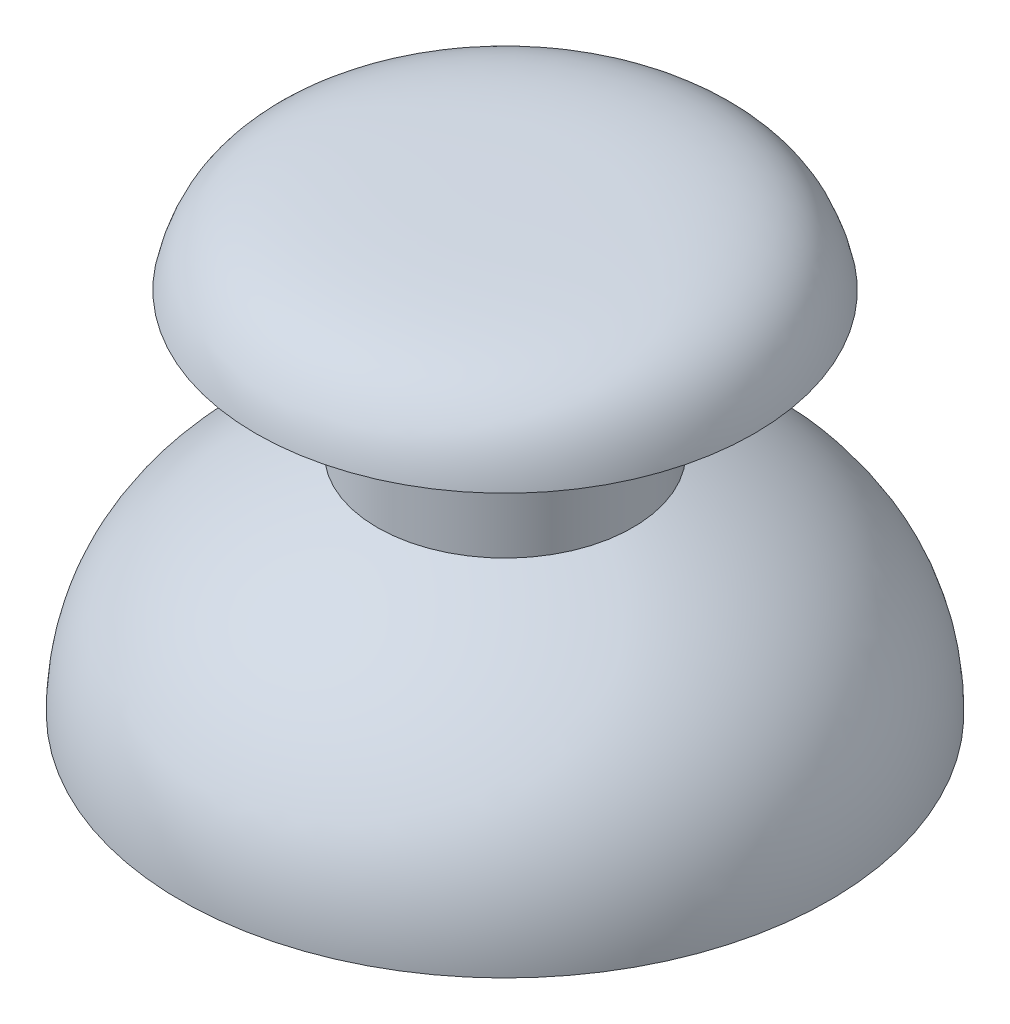
ISO-10303-21;
HEADER;
FILE_DESCRIPTION(('STEP AP214'),'2;1');
FILE_NAME('part.step','',(''),(''),'','','');
FILE_SCHEMA(('AUTOMOTIVE_DESIGN { 1 0 10303 214 1 1 1 1 }'));
ENDSEC;
DATA;
#1=APPLICATION_CONTEXT('core data for automotive mechanical design processes');
#2=APPLICATION_PROTOCOL_DEFINITION('international standard','automotive_design',2000,#1);
#3=PRODUCT_CONTEXT('',#1,'mechanical');
#4=PRODUCT('Part','Part','',(#3));
#5=PRODUCT_RELATED_PRODUCT_CATEGORY('part','',(#4));
#6=PRODUCT_DEFINITION_FORMATION('','',#4);
#7=PRODUCT_DEFINITION_CONTEXT('part definition',#1,'design');
#8=PRODUCT_DEFINITION('design','',#6,#7);
#9=PRODUCT_DEFINITION_SHAPE('','',#8);
#10=(LENGTH_UNIT() NAMED_UNIT(*) SI_UNIT(.MILLI.,.METRE.));
#11=(NAMED_UNIT(*) PLANE_ANGLE_UNIT() SI_UNIT($,.RADIAN.));
#12=(NAMED_UNIT(*) SI_UNIT($,.STERADIAN.) SOLID_ANGLE_UNIT());
#13=UNCERTAINTY_MEASURE_WITH_UNIT(LENGTH_MEASURE(1.E-05),#10,'distance_accuracy_value','');
#14=(GEOMETRIC_REPRESENTATION_CONTEXT(3) GLOBAL_UNCERTAINTY_ASSIGNED_CONTEXT((#13)) GLOBAL_UNIT_ASSIGNED_CONTEXT((#10,
#11,#12)) REPRESENTATION_CONTEXT('',''));
#15=CARTESIAN_POINT('',(0.,0.,0.));
#16=DIRECTION('',(0.,0.,1.));
#17=DIRECTION('',(1.,0.,0.));
#18=AXIS2_PLACEMENT_3D('',#15,#16,#17);
#19=CARTESIAN_POINT('',(0.,8.93607267068107,4.28417266486361));
#20=CARTESIAN_POINT('',(0.,8.85738178045405,4.50611510990907));
#21=CARTESIAN_POINT('',(0.,8.77869089022702,4.72805755495454));
#22=CARTESIAN_POINT('',(0.,8.7,4.95));
#23=CARTESIAN_POINT('',(0.,7.34033976746877,8.78483165037869));
#24=CARTESIAN_POINT('',(0.,4.78192588649418,12.5687261289951));
#25=CARTESIAN_POINT('',(0.,0.,12.5687261289951));
#26=B_SPLINE_CURVE_WITH_KNOTS('',3,(#19,#20,#21,#22,#23,#24,#25),.UNSPECIFIED.,.F.,.F.,(4,3,4),
(-0.0578754076527833,0.,1.),.UNSPECIFIED.);
#27=CARTESIAN_POINT('',(0.,0.,0.));
#28=DIRECTION('',(0.,-1.,0.));
#29=AXIS1_PLACEMENT('',#27,#28);
#30=SURFACE_OF_REVOLUTION('',#26,#29);
#31=CARTESIAN_POINT('',(0.,0.,0.));
#32=DIRECTION('',(0.,-1.,0.));
#33=DIRECTION('',(0.,0.,-1.));
#34=AXIS2_PLACEMENT_3D('',#31,#32,#33);
#35=CIRCLE('',#34,12.5687261289951);
#36=CARTESIAN_POINT('',(0.,0.,-12.5687261289951));
#37=VERTEX_POINT('',#36);
#38=EDGE_CURVE('E74',#37,#37,#35,.T.);
#39=ORIENTED_EDGE('',*,*,#38,.F.);
#40=EDGE_LOOP('',(#39));
#41=FACE_BOUND('',#40,.T.);
#42=CARTESIAN_POINT('',(0.,8.7,0.));
#43=DIRECTION('',(0.,-1.,0.));
#44=DIRECTION('',(0.,0.,-1.));
#45=AXIS2_PLACEMENT_3D('',#42,#43,#44);
#46=CIRCLE('',#45,4.95);
#47=CARTESIAN_POINT('',(0.,8.7,-4.95));
#48=VERTEX_POINT('',#47);
#49=EDGE_CURVE('E11',#48,#48,#46,.T.);
#50=ORIENTED_EDGE('',*,*,#49,.T.);
#51=EDGE_LOOP('',(#50));
#52=FACE_BOUND('',#51,.T.);
#53=ADVANCED_FACE('F17',(#41,#52),#30,.T.);
#54=CARTESIAN_POINT('',(0.,0.,0.));
#55=DIRECTION('',(0.,-1.,0.));
#56=DIRECTION('',(0.,0.,-1.));
#57=AXIS2_PLACEMENT_3D('',#54,#55,#56);
#58=CYLINDRICAL_SURFACE('',#57,4.95);
#59=ORIENTED_EDGE('',*,*,#49,.F.);
#60=EDGE_LOOP('',(#59));
#61=FACE_BOUND('',#60,.T.);
#62=CARTESIAN_POINT('',(0.,13.7,0.));
#63=DIRECTION('',(0.,-1.,0.));
#64=DIRECTION('',(0.,0.,-1.));
#65=AXIS2_PLACEMENT_3D('',#62,#63,#64);
#66=CIRCLE('',#65,4.95);
#67=CARTESIAN_POINT('',(0.,13.7,-4.95));
#68=VERTEX_POINT('',#67);
#69=EDGE_CURVE('E25',#68,#68,#66,.T.);
#70=ORIENTED_EDGE('',*,*,#69,.T.);
#71=EDGE_LOOP('',(#70));
#72=FACE_BOUND('',#71,.T.);
#73=ADVANCED_FACE('F19',(#61,#72),#58,.T.);
#74=CARTESIAN_POINT('',(0.,14.2,0.));
#75=DIRECTION('',(0.,1.,0.));
#76=DIRECTION('',(0.,0.,1.));
#77=AXIS2_PLACEMENT_3D('',#74,#75,#76);
#78=CONICAL_SURFACE('',#77,9.65,1.4648119688053);
#79=ORIENTED_EDGE('',*,*,#69,.F.);
#80=EDGE_LOOP('',(#79));
#81=FACE_BOUND('',#80,.T.);
#82=CARTESIAN_POINT('',(0.,14.2,0.));
#83=DIRECTION('',(0.,-1.,0.));
#84=DIRECTION('',(0.,0.,-1.));
#85=AXIS2_PLACEMENT_3D('',#82,#83,#84);
#86=CIRCLE('',#85,9.65);
#87=CARTESIAN_POINT('',(0.,14.2,-9.65));
#88=VERTEX_POINT('',#87);
#89=EDGE_CURVE('E96',#88,#88,#86,.T.);
#90=ORIENTED_EDGE('',*,*,#89,.T.);
#91=EDGE_LOOP('',(#90));
#92=FACE_BOUND('',#91,.T.);
#93=ADVANCED_FACE('F51',(#81,#92),#78,.T.);
#94=CARTESIAN_POINT('',(0.,17.6,0.));
#95=CARTESIAN_POINT('',(0.,17.6,6.20469093630731));
#96=CARTESIAN_POINT('',(0.,17.5655279296969,8.93688542802643));
#97=CARTESIAN_POINT('',(0.,14.2,9.65));
#98=B_SPLINE_CURVE_WITH_KNOTS('',3,(#94,#95,#96,#97),.UNSPECIFIED.,.F.,.F.,(4,4),(0.,1.),.UNSPECIFIED.);
#99=CARTESIAN_POINT('',(0.,0.,0.));
#100=DIRECTION('',(0.,-1.,0.));
#101=AXIS1_PLACEMENT('',#99,#100);
#102=SURFACE_OF_REVOLUTION('',#98,#101);
#103=ORIENTED_EDGE('',*,*,#89,.F.);
#104=EDGE_LOOP('',(#103));
#105=FACE_BOUND('',#104,.T.);
#106=CARTESIAN_POINT('',(0.,17.6,0.));
#107=VERTEX_POINT('',#106);
#108=VERTEX_LOOP('',#107);
#109=FACE_BOUND('',#108,.T.);
#110=ADVANCED_FACE('F79',(#105,#109),#102,.T.);
#111=CARTESIAN_POINT('',(0.,0.,12.5687261289951));
#112=DIRECTION('',(0.,1.,0.));
#113=DIRECTION('',(0.,0.,1.));
#114=AXIS2_PLACEMENT_3D('',#111,#112,#113);
#115=PLANE('',#114);
#116=CARTESIAN_POINT('',(0.,0.,0.));
#117=DIRECTION('',(0.,-1.,0.));
#118=DIRECTION('',(0.,0.,-1.));
#119=AXIS2_PLACEMENT_3D('',#116,#117,#118);
#120=CIRCLE('',#119,11.5687261289951);
#121=CARTESIAN_POINT('',(0.,0.,-11.5687261289951));
#122=VERTEX_POINT('',#121);
#123=EDGE_CURVE('E65',#122,#122,#120,.T.);
#124=ORIENTED_EDGE('',*,*,#123,.F.);
#125=EDGE_LOOP('',(#124));
#126=FACE_BOUND('',#125,.T.);
#127=ORIENTED_EDGE('',*,*,#38,.T.);
#128=EDGE_LOOP('',(#127));
#129=FACE_BOUND('',#128,.T.);
#130=ADVANCED_FACE('F83',(#126,#129),#115,.F.);
#131=CARTESIAN_POINT('',(0.,8.93607267068107,4.28417266486361));
#132=CARTESIAN_POINT('',(0.,8.85738178045405,4.50611510990907));
#133=CARTESIAN_POINT('',(0.,8.77869089022702,4.72805755495454));
#134=CARTESIAN_POINT('',(0.,7.34033976746877,8.78483165037869));
#135=CARTESIAN_POINT('',(0.,4.78192588649418,12.5687261289951));
#136=CARTESIAN_POINT('',(0.,0.,12.5687261289951));
#137=B_SPLINE_CURVE_WITH_KNOTS('',3,(#131,#132,#133,#134,#135,#136),.UNSPECIFIED.,.F.,.F.,(4,2,
4),(-0.0578754076527833,0.,1.),.UNSPECIFIED.);
#138=CARTESIAN_POINT('',(0.,0.,0.));
#139=DIRECTION('',(0.,-1.,0.));
#140=AXIS1_PLACEMENT('',#138,#139);
#141=SURFACE_OF_REVOLUTION('',#137,#140);
#142=OFFSET_SURFACE('',#141,-1.,.F.);
#143=ORIENTED_EDGE('',*,*,#123,.T.);
#144=EDGE_LOOP('',(#143));
#145=FACE_BOUND('',#144,.T.);
#146=CARTESIAN_POINT('',(0.,7.99356079804606,0.));
#147=DIRECTION('',(0.,-1.,0.));
#148=DIRECTION('',(0.,0.,-1.));
#149=AXIS2_PLACEMENT_3D('',#146,#147,#148);
#150=CIRCLE('',#149,3.95);
#151=CARTESIAN_POINT('',(0.,7.99356079804606,-3.95));
#152=VERTEX_POINT('',#151);
#153=EDGE_CURVE('E98',#152,#152,#150,.T.);
#154=ORIENTED_EDGE('',*,*,#153,.F.);
#155=EDGE_LOOP('',(#154));
#156=FACE_BOUND('',#155,.T.);
#157=ADVANCED_FACE('F59',(#145,#156),#142,.F.);
#158=CARTESIAN_POINT('',(0.,0.,0.));
#159=DIRECTION('',(0.,-1.,0.));
#160=DIRECTION('',(0.,0.,-1.));
#161=AXIS2_PLACEMENT_3D('',#158,#159,#160);
#162=CYLINDRICAL_SURFACE('',#161,3.95);
#163=ORIENTED_EDGE('',*,*,#153,.T.);
#164=EDGE_LOOP('',(#163));
#165=FACE_BOUND('',#164,.T.);
#166=CARTESIAN_POINT('',(0.,14.5992597700508,0.));
#167=DIRECTION('',(0.,1.,0.));
#168=DIRECTION('',(0.,0.,1.));
#169=AXIS2_PLACEMENT_3D('',#166,#167,#168);
#170=CIRCLE('',#169,3.95);
#171=CARTESIAN_POINT('',(0.,14.5992597700508,3.95));
#172=VERTEX_POINT('',#171);
#173=EDGE_CURVE('E101',#172,#172,#170,.F.);
#174=ORIENTED_EDGE('',*,*,#173,.F.);
#175=EDGE_LOOP('',(#174));
#176=FACE_BOUND('',#175,.T.);
#177=ADVANCED_FACE('F40',(#165,#176),#162,.F.);
#178=CARTESIAN_POINT('',(0.,15.1943889131791,0.));
#179=DIRECTION('',(0.,1.,0.));
#180=DIRECTION('',(0.,0.,1.));
#181=AXIS2_PLACEMENT_3D('',#178,#179,#180);
#182=CONICAL_SURFACE('',#181,9.54421394540648,1.4648119688053);
#183=ORIENTED_EDGE('',*,*,#173,.T.);
#184=EDGE_LOOP('',(#183));
#185=FACE_BOUND('',#184,.T.);
#186=CARTESIAN_POINT('',(0.,15.0607366533768,0.));
#187=DIRECTION('',(0.,-1.,0.));
#188=DIRECTION('',(0.,0.,-1.));
#189=AXIS2_PLACEMENT_3D('',#186,#187,#188);
#190=CIRCLE('',#189,8.28788270326431);
#191=CARTESIAN_POINT('',(0.,15.0607366533768,-8.28788270326431));
#192=VERTEX_POINT('',#191);
#193=EDGE_CURVE('E106',#192,#192,#190,.T.);
#194=ORIENTED_EDGE('',*,*,#193,.F.);
#195=EDGE_LOOP('',(#194));
#196=FACE_BOUND('',#195,.T.);
#197=ADVANCED_FACE('F33',(#185,#196),#182,.F.);
#198=CARTESIAN_POINT('',(0.,17.6,0.));
#199=CARTESIAN_POINT('',(0.,17.6,6.20469093630731));
#200=CARTESIAN_POINT('',(0.,17.5655279296969,8.93688542802643));
#201=CARTESIAN_POINT('',(0.,14.2,9.65));
#202=B_SPLINE_CURVE_WITH_KNOTS('',3,(#198,#199,#200,#201),.UNSPECIFIED.,.F.,.F.,(4,4),(0.,1.),.UNSPECIFIED.);
#203=CARTESIAN_POINT('',(0.,0.,0.));
#204=DIRECTION('',(0.,-1.,0.));
#205=AXIS1_PLACEMENT('',#203,#204);
#206=SURFACE_OF_REVOLUTION('',#202,#205);
#207=OFFSET_SURFACE('',#206,-1.,.F.);
#208=ORIENTED_EDGE('',*,*,#193,.T.);
#209=EDGE_LOOP('',(#208));
#210=FACE_BOUND('',#209,.T.);
#211=CARTESIAN_POINT('',(0.,16.6,0.));
#212=VERTEX_POINT('',#211);
#213=VERTEX_LOOP('',#212);
#214=FACE_BOUND('',#213,.T.);
#215=ADVANCED_FACE('F31',(#210,#214),#207,.F.);
#216=CLOSED_SHELL('',(#53,#73,#93,#110,#130,#157,#177,#197,#215));
#217=MANIFOLD_SOLID_BREP('B1',#216);
#218=ADVANCED_BREP_SHAPE_REPRESENTATION('',(#18,#217),#14);
#219=SHAPE_DEFINITION_REPRESENTATION(#9,#218);
ENDSEC;
END-ISO-10303-21;
